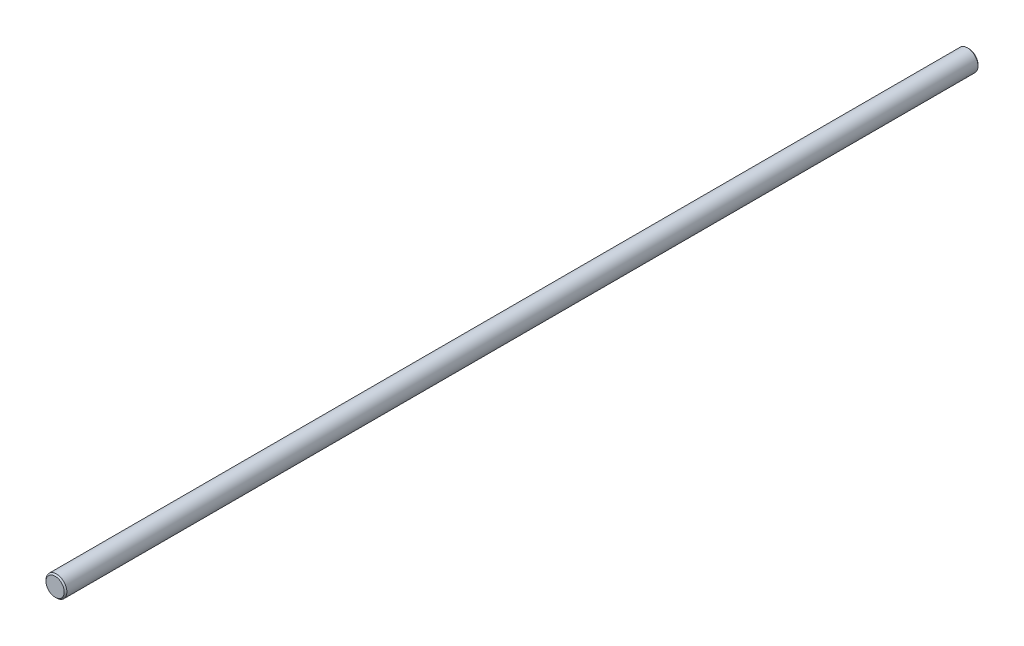
ISO-10303-21;
HEADER;
FILE_DESCRIPTION(('STEP AP214'),'2;1');
FILE_NAME('part.step','',(''),(''),'','','');
FILE_SCHEMA(('AUTOMOTIVE_DESIGN { 1 0 10303 214 1 1 1 1 }'));
ENDSEC;
DATA;
#1=APPLICATION_CONTEXT('core data for automotive mechanical design processes');
#2=APPLICATION_PROTOCOL_DEFINITION('international standard','automotive_design',2000,#1);
#3=PRODUCT_CONTEXT('',#1,'mechanical');
#4=PRODUCT('Part','Part','',(#3));
#5=PRODUCT_RELATED_PRODUCT_CATEGORY('part','',(#4));
#6=PRODUCT_DEFINITION_FORMATION('','',#4);
#7=PRODUCT_DEFINITION_CONTEXT('part definition',#1,'design');
#8=PRODUCT_DEFINITION('design','',#6,#7);
#9=PRODUCT_DEFINITION_SHAPE('','',#8);
#10=(LENGTH_UNIT() NAMED_UNIT(*) SI_UNIT(.MILLI.,.METRE.));
#11=(NAMED_UNIT(*) PLANE_ANGLE_UNIT() SI_UNIT($,.RADIAN.));
#12=(NAMED_UNIT(*) SI_UNIT($,.STERADIAN.) SOLID_ANGLE_UNIT());
#13=UNCERTAINTY_MEASURE_WITH_UNIT(LENGTH_MEASURE(1.E-05),#10,'distance_accuracy_value','');
#14=(GEOMETRIC_REPRESENTATION_CONTEXT(3) GLOBAL_UNCERTAINTY_ASSIGNED_CONTEXT((#13)) GLOBAL_UNIT_ASSIGNED_CONTEXT((#10,
#11,#12)) REPRESENTATION_CONTEXT('',''));
#15=CARTESIAN_POINT('',(0.,0.,0.));
#16=DIRECTION('',(0.,0.,1.));
#17=DIRECTION('',(1.,0.,0.));
#18=AXIS2_PLACEMENT_3D('',#15,#16,#17);
#19=CARTESIAN_POINT('',(0.,0.,-350.));
#20=DIRECTION('',(0.,0.,1.));
#21=DIRECTION('',(1.,0.,0.));
#22=AXIS2_PLACEMENT_3D('',#19,#20,#21);
#23=CYLINDRICAL_SURFACE('',#22,4.);
#24=CARTESIAN_POINT('',(0.,0.,-349.5));
#25=DIRECTION('',(0.,0.,1.));
#26=DIRECTION('',(1.,0.,0.));
#27=AXIS2_PLACEMENT_3D('',#24,#25,#26);
#28=CIRCLE('',#27,4.);
#29=CARTESIAN_POINT('',(4.,0.,-349.5));
#30=VERTEX_POINT('',#29);
#31=EDGE_CURVE('E43',#30,#30,#28,.T.);
#32=ORIENTED_EDGE('',*,*,#31,.T.);
#33=EDGE_LOOP('',(#32));
#34=FACE_BOUND('',#33,.T.);
#35=CARTESIAN_POINT('',(0.,0.,-0.499999999999945));
#36=DIRECTION('',(0.,0.,1.));
#37=DIRECTION('',(1.,0.,0.));
#38=AXIS2_PLACEMENT_3D('',#35,#36,#37);
#39=CIRCLE('',#38,4.);
#40=CARTESIAN_POINT('',(4.,0.,-0.499999999999945));
#41=VERTEX_POINT('',#40);
#42=EDGE_CURVE('E47',#41,#41,#39,.F.);
#43=ORIENTED_EDGE('',*,*,#42,.T.);
#44=EDGE_LOOP('',(#43));
#45=FACE_BOUND('',#44,.T.);
#46=ADVANCED_FACE('F32',(#34,#45),#23,.T.);
#47=CARTESIAN_POINT('',(0.,0.,-350.));
#48=DIRECTION('',(0.,0.,1.));
#49=DIRECTION('',(1.,0.,0.));
#50=AXIS2_PLACEMENT_3D('',#47,#48,#49);
#51=PLANE('',#50);
#52=CARTESIAN_POINT('',(0.,0.,-350.));
#53=DIRECTION('',(0.,0.,1.));
#54=DIRECTION('',(1.,0.,0.));
#55=AXIS2_PLACEMENT_3D('',#52,#53,#54);
#56=CIRCLE('',#55,3.49999999999995);
#57=CARTESIAN_POINT('',(3.49999999999995,0.,-350.));
#58=VERTEX_POINT('',#57);
#59=EDGE_CURVE('E39',#58,#58,#56,.F.);
#60=ORIENTED_EDGE('',*,*,#59,.T.);
#61=EDGE_LOOP('',(#60));
#62=FACE_BOUND('',#61,.T.);
#63=ADVANCED_FACE('F63',(#62),#51,.F.);
#64=CARTESIAN_POINT('',(0.,0.,0.));
#65=DIRECTION('',(0.,0.,1.));
#66=DIRECTION('',(1.,0.,0.));
#67=AXIS2_PLACEMENT_3D('',#64,#65,#66);
#68=PLANE('',#67);
#69=CARTESIAN_POINT('',(0.,0.,0.));
#70=DIRECTION('',(0.,0.,1.));
#71=DIRECTION('',(1.,0.,0.));
#72=AXIS2_PLACEMENT_3D('',#69,#70,#71);
#73=CIRCLE('',#72,3.50000000000003);
#74=CARTESIAN_POINT('',(3.50000000000003,0.,0.));
#75=VERTEX_POINT('',#74);
#76=EDGE_CURVE('E10',#75,#75,#73,.T.);
#77=ORIENTED_EDGE('',*,*,#76,.T.);
#78=EDGE_LOOP('',(#77));
#79=FACE_BOUND('',#78,.T.);
#80=ADVANCED_FACE('F60',(#79),#68,.T.);
#81=CARTESIAN_POINT('',(0.,0.,-349.5));
#82=DIRECTION('',(0.,0.,1.));
#83=DIRECTION('',(1.,0.,0.));
#84=AXIS2_PLACEMENT_3D('',#81,#82,#83);
#85=CONICAL_SURFACE('',#84,4.,0.785398163397445);
#86=ORIENTED_EDGE('',*,*,#59,.F.);
#87=EDGE_LOOP('',(#86));
#88=FACE_BOUND('',#87,.T.);
#89=ORIENTED_EDGE('',*,*,#31,.F.);
#90=EDGE_LOOP('',(#89));
#91=FACE_BOUND('',#90,.T.);
#92=ADVANCED_FACE('F56',(#88,#91),#85,.T.);
#93=CARTESIAN_POINT('',(0.,0.,0.));
#94=DIRECTION('',(0.,0.,-1.));
#95=DIRECTION('',(-1.,0.,0.));
#96=AXIS2_PLACEMENT_3D('',#93,#94,#95);
#97=CONICAL_SURFACE('',#96,3.50000000000003,0.785398163397473);
#98=ORIENTED_EDGE('',*,*,#42,.F.);
#99=EDGE_LOOP('',(#98));
#100=FACE_BOUND('',#99,.T.);
#101=ORIENTED_EDGE('',*,*,#76,.F.);
#102=EDGE_LOOP('',(#101));
#103=FACE_BOUND('',#102,.T.);
#104=ADVANCED_FACE('F34',(#100,#103),#97,.T.);
#105=CLOSED_SHELL('',(#46,#63,#80,#92,#104));
#106=MANIFOLD_SOLID_BREP('B2',#105);
#107=ADVANCED_BREP_SHAPE_REPRESENTATION('',(#18,#106),#14);
#108=SHAPE_DEFINITION_REPRESENTATION(#9,#107);
ENDSEC;
END-ISO-10303-21;
